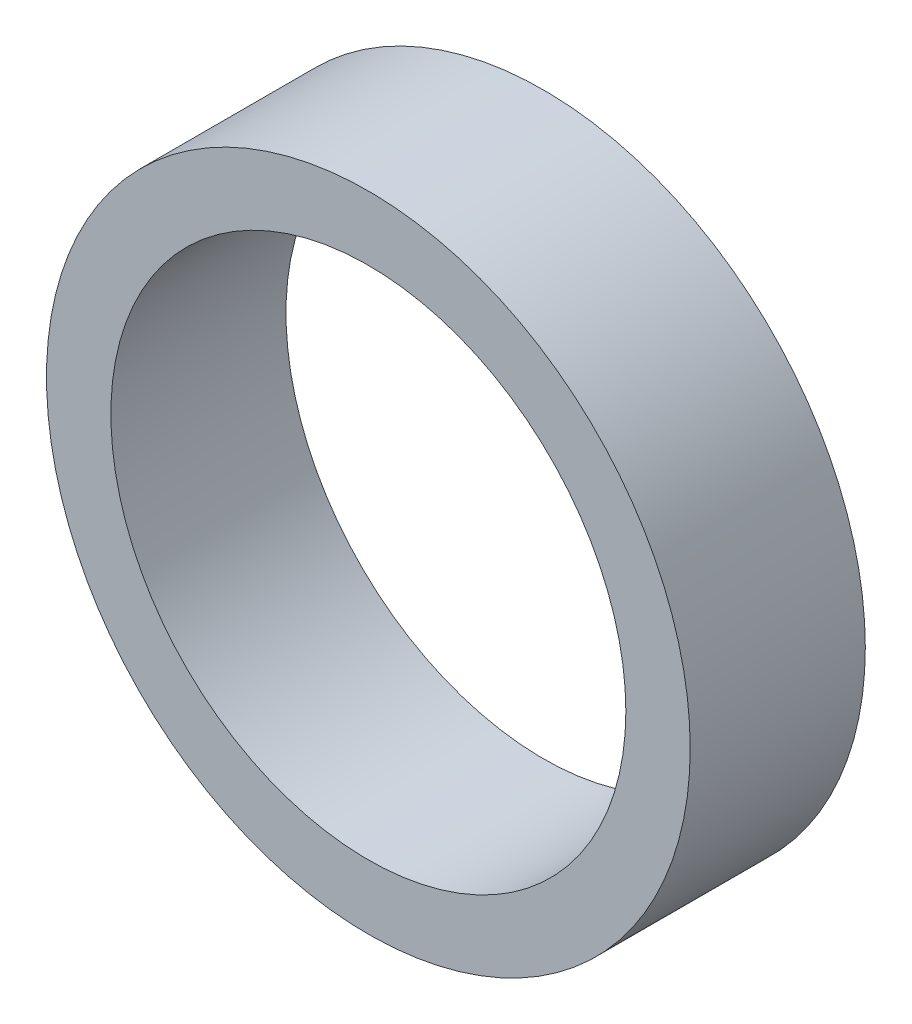
ISO-10303-21;
HEADER;
FILE_DESCRIPTION(('STEP AP214'),'2;1');
FILE_NAME('part.step','',(''),(''),'','','');
FILE_SCHEMA(('AUTOMOTIVE_DESIGN { 1 0 10303 214 1 1 1 1 }'));
ENDSEC;
DATA;
#1=APPLICATION_CONTEXT('core data for automotive mechanical design processes');
#2=APPLICATION_PROTOCOL_DEFINITION('international standard','automotive_design',2000,#1);
#3=PRODUCT_CONTEXT('',#1,'mechanical');
#4=PRODUCT('Part','Part','',(#3));
#5=PRODUCT_RELATED_PRODUCT_CATEGORY('part','',(#4));
#6=PRODUCT_DEFINITION_FORMATION('','',#4);
#7=PRODUCT_DEFINITION_CONTEXT('part definition',#1,'design');
#8=PRODUCT_DEFINITION('design','',#6,#7);
#9=PRODUCT_DEFINITION_SHAPE('','',#8);
#10=(LENGTH_UNIT() NAMED_UNIT(*) SI_UNIT(.MILLI.,.METRE.));
#11=(NAMED_UNIT(*) PLANE_ANGLE_UNIT() SI_UNIT($,.RADIAN.));
#12=(NAMED_UNIT(*) SI_UNIT($,.STERADIAN.) SOLID_ANGLE_UNIT());
#13=UNCERTAINTY_MEASURE_WITH_UNIT(LENGTH_MEASURE(1.E-05),#10,'distance_accuracy_value','');
#14=(GEOMETRIC_REPRESENTATION_CONTEXT(3) GLOBAL_UNCERTAINTY_ASSIGNED_CONTEXT((#13)) GLOBAL_UNIT_ASSIGNED_CONTEXT((#10,
#11,#12)) REPRESENTATION_CONTEXT('',''));
#15=CARTESIAN_POINT('',(0.,0.,0.));
#16=DIRECTION('',(0.,0.,1.));
#17=DIRECTION('',(1.,0.,0.));
#18=AXIS2_PLACEMENT_3D('',#15,#16,#17);
#19=CARTESIAN_POINT('',(0.,0.,2.159));
#20=DIRECTION('',(0.,0.,1.));
#21=DIRECTION('',(1.,0.,0.));
#22=AXIS2_PLACEMENT_3D('',#19,#20,#21);
#23=PLANE('',#22);
#24=CARTESIAN_POINT('',(0.,0.,2.159));
#25=DIRECTION('',(0.,0.,1.));
#26=DIRECTION('',(1.,0.,0.));
#27=AXIS2_PLACEMENT_3D('',#24,#25,#26);
#28=CIRCLE('',#27,3.96875);
#29=CARTESIAN_POINT('',(3.96875,0.,2.159));
#30=VERTEX_POINT('',#29);
#31=EDGE_CURVE('E10',#30,#30,#28,.T.);
#32=ORIENTED_EDGE('',*,*,#31,.T.);
#33=EDGE_LOOP('',(#32));
#34=FACE_BOUND('',#33,.T.);
#35=CARTESIAN_POINT('',(0.,0.,2.159));
#36=DIRECTION('',(0.,0.,1.));
#37=DIRECTION('',(1.,0.,0.));
#38=AXIS2_PLACEMENT_3D('',#35,#36,#37);
#39=CIRCLE('',#38,3.175);
#40=CARTESIAN_POINT('',(3.175,0.,2.159));
#41=VERTEX_POINT('',#40);
#42=EDGE_CURVE('E43',#41,#41,#39,.T.);
#43=ORIENTED_EDGE('',*,*,#42,.F.);
#44=EDGE_LOOP('',(#43));
#45=FACE_BOUND('',#44,.T.);
#46=ADVANCED_FACE('F32',(#34,#45),#23,.T.);
#47=CARTESIAN_POINT('',(0.,0.,0.));
#48=DIRECTION('',(0.,0.,1.));
#49=DIRECTION('',(1.,0.,0.));
#50=AXIS2_PLACEMENT_3D('',#47,#48,#49);
#51=PLANE('',#50);
#52=CARTESIAN_POINT('',(0.,0.,0.));
#53=DIRECTION('',(0.,0.,1.));
#54=DIRECTION('',(1.,0.,0.));
#55=AXIS2_PLACEMENT_3D('',#52,#53,#54);
#56=CIRCLE('',#55,3.96875);
#57=CARTESIAN_POINT('',(3.96875,0.,0.));
#58=VERTEX_POINT('',#57);
#59=EDGE_CURVE('E36',#58,#58,#56,.T.);
#60=ORIENTED_EDGE('',*,*,#59,.F.);
#61=EDGE_LOOP('',(#60));
#62=FACE_BOUND('',#61,.T.);
#63=CARTESIAN_POINT('',(0.,0.,0.));
#64=DIRECTION('',(0.,0.,1.));
#65=DIRECTION('',(1.,0.,0.));
#66=AXIS2_PLACEMENT_3D('',#63,#64,#65);
#67=CIRCLE('',#66,3.175);
#68=CARTESIAN_POINT('',(3.175,0.,0.));
#69=VERTEX_POINT('',#68);
#70=EDGE_CURVE('E45',#69,#69,#67,.T.);
#71=ORIENTED_EDGE('',*,*,#70,.T.);
#72=EDGE_LOOP('',(#71));
#73=FACE_BOUND('',#72,.T.);
#74=ADVANCED_FACE('F55',(#62,#73),#51,.F.);
#75=CARTESIAN_POINT('',(0.,0.,2.159));
#76=DIRECTION('',(0.,0.,-1.));
#77=DIRECTION('',(-1.,0.,0.));
#78=AXIS2_PLACEMENT_3D('',#75,#76,#77);
#79=CYLINDRICAL_SURFACE('',#78,3.96875);
#80=ORIENTED_EDGE('',*,*,#31,.F.);
#81=EDGE_LOOP('',(#80));
#82=FACE_BOUND('',#81,.T.);
#83=ORIENTED_EDGE('',*,*,#59,.T.);
#84=EDGE_LOOP('',(#83));
#85=FACE_BOUND('',#84,.T.);
#86=ADVANCED_FACE('F34',(#82,#85),#79,.T.);
#87=CARTESIAN_POINT('',(0.,0.,2.159));
#88=DIRECTION('',(0.,0.,-1.));
#89=DIRECTION('',(-1.,0.,0.));
#90=AXIS2_PLACEMENT_3D('',#87,#88,#89);
#91=CYLINDRICAL_SURFACE('',#90,3.175);
#92=ORIENTED_EDGE('',*,*,#42,.T.);
#93=EDGE_LOOP('',(#92));
#94=FACE_BOUND('',#93,.T.);
#95=ORIENTED_EDGE('',*,*,#70,.F.);
#96=EDGE_LOOP('',(#95));
#97=FACE_BOUND('',#96,.T.);
#98=ADVANCED_FACE('F51',(#94,#97),#91,.F.);
#99=CLOSED_SHELL('',(#46,#74,#86,#98));
#100=MANIFOLD_SOLID_BREP('B2',#99);
#101=ADVANCED_BREP_SHAPE_REPRESENTATION('',(#18,#100),#14);
#102=SHAPE_DEFINITION_REPRESENTATION(#9,#101);
ENDSEC;
END-ISO-10303-21;
